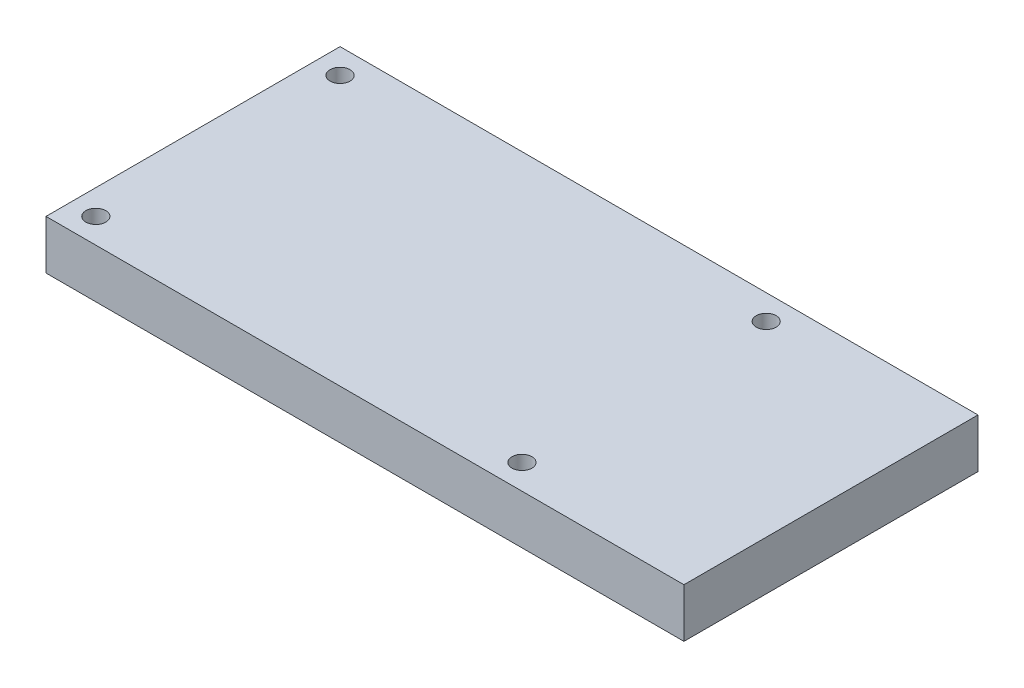
ISO-10303-21;
HEADER;
FILE_DESCRIPTION(('STEP AP214'),'2;1');
FILE_NAME('part.step','',(''),(''),'','','');
FILE_SCHEMA(('AUTOMOTIVE_DESIGN { 1 0 10303 214 1 1 1 1 }'));
ENDSEC;
DATA;
#1=APPLICATION_CONTEXT('core data for automotive mechanical design processes');
#2=APPLICATION_PROTOCOL_DEFINITION('international standard','automotive_design',2000,#1);
#3=PRODUCT_CONTEXT('',#1,'mechanical');
#4=PRODUCT('Part','Part','',(#3));
#5=PRODUCT_RELATED_PRODUCT_CATEGORY('part','',(#4));
#6=PRODUCT_DEFINITION_FORMATION('','',#4);
#7=PRODUCT_DEFINITION_CONTEXT('part definition',#1,'design');
#8=PRODUCT_DEFINITION('design','',#6,#7);
#9=PRODUCT_DEFINITION_SHAPE('','',#8);
#10=(LENGTH_UNIT() NAMED_UNIT(*) SI_UNIT(.MILLI.,.METRE.));
#11=(NAMED_UNIT(*) PLANE_ANGLE_UNIT() SI_UNIT($,.RADIAN.));
#12=(NAMED_UNIT(*) SI_UNIT($,.STERADIAN.) SOLID_ANGLE_UNIT());
#13=UNCERTAINTY_MEASURE_WITH_UNIT(LENGTH_MEASURE(1.E-05),#10,'distance_accuracy_value','');
#14=(GEOMETRIC_REPRESENTATION_CONTEXT(3) GLOBAL_UNCERTAINTY_ASSIGNED_CONTEXT((#13)) GLOBAL_UNIT_ASSIGNED_CONTEXT((#10,
#11,#12)) REPRESENTATION_CONTEXT('',''));
#15=CARTESIAN_POINT('',(0.,0.,0.));
#16=DIRECTION('',(0.,0.,1.));
#17=DIRECTION('',(1.,0.,0.));
#18=AXIS2_PLACEMENT_3D('',#15,#16,#17);
#19=CARTESIAN_POINT('',(0.,5.0038,0.));
#20=DIRECTION('',(0.,-1.,0.));
#21=DIRECTION('',(0.,0.,-1.));
#22=AXIS2_PLACEMENT_3D('',#19,#20,#21);
#23=PLANE('',#22);
#24=DIRECTION('',(0.,0.,-1.));
#25=VECTOR('',#24,1.);
#26=CARTESIAN_POINT('',(32.512,5.0038,14.986));
#27=LINE('',#26,#25);
#28=CARTESIAN_POINT('',(32.512,5.0038,14.986));
#29=VERTEX_POINT('',#28);
#30=CARTESIAN_POINT('',(32.512,5.0038,-14.986));
#31=VERTEX_POINT('',#30);
#32=EDGE_CURVE('E89',#29,#31,#27,.T.);
#33=ORIENTED_EDGE('',*,*,#32,.T.);
#34=DIRECTION('',(-1.,0.,0.));
#35=VECTOR('',#34,1.);
#36=CARTESIAN_POINT('',(-32.512,5.0038,-14.986));
#37=LINE('',#36,#35);
#38=CARTESIAN_POINT('',(-32.512,5.0038,-14.986));
#39=VERTEX_POINT('',#38);
#40=EDGE_CURVE('E84',#31,#39,#37,.T.);
#41=ORIENTED_EDGE('',*,*,#40,.T.);
#42=DIRECTION('',(0.,0.,1.));
#43=VECTOR('',#42,1.);
#44=CARTESIAN_POINT('',(-32.512,5.0038,14.986));
#45=LINE('',#44,#43);
#46=CARTESIAN_POINT('',(-32.512,5.0038,14.986));
#47=VERTEX_POINT('',#46);
#48=EDGE_CURVE('E87',#39,#47,#45,.T.);
#49=ORIENTED_EDGE('',*,*,#48,.T.);
#50=DIRECTION('',(1.,0.,0.));
#51=VECTOR('',#50,1.);
#52=CARTESIAN_POINT('',(-32.512,5.0038,14.986));
#53=LINE('',#52,#51);
#54=EDGE_CURVE('E54',#47,#29,#53,.T.);
#55=ORIENTED_EDGE('',*,*,#54,.T.);
#56=EDGE_LOOP('',(#33,#41,#49,#55));
#57=FACE_BOUND('',#56,.T.);
#58=CARTESIAN_POINT('',(-29.972,5.0038,-12.446));
#59=DIRECTION('',(0.,1.,0.));
#60=DIRECTION('',(0.,0.,1.));
#61=AXIS2_PLACEMENT_3D('',#58,#59,#60);
#62=CIRCLE('',#61,1.016);
#63=CARTESIAN_POINT('',(-29.972,5.0038,-11.43));
#64=VERTEX_POINT('',#63);
#65=EDGE_CURVE('E104',#64,#64,#62,.T.);
#66=ORIENTED_EDGE('',*,*,#65,.F.);
#67=EDGE_LOOP('',(#66));
#68=FACE_BOUND('',#67,.T.);
#69=CARTESIAN_POINT('',(-29.972,5.0038,12.446));
#70=DIRECTION('',(0.,1.,0.));
#71=DIRECTION('',(0.,0.,-1.));
#72=AXIS2_PLACEMENT_3D('',#69,#70,#71);
#73=CIRCLE('',#72,1.016);
#74=CARTESIAN_POINT('',(-29.972,5.0038,11.43));
#75=VERTEX_POINT('',#74);
#76=EDGE_CURVE('E119',#75,#75,#73,.T.);
#77=ORIENTED_EDGE('',*,*,#76,.F.);
#78=EDGE_LOOP('',(#77));
#79=FACE_BOUND('',#78,.T.);
#80=CARTESIAN_POINT('',(13.462,5.0038,-12.446));
#81=DIRECTION('',(0.,1.,0.));
#82=DIRECTION('',(0.,0.,1.));
#83=AXIS2_PLACEMENT_3D('',#80,#81,#82);
#84=CIRCLE('',#83,1.016);
#85=CARTESIAN_POINT('',(13.462,5.0038,-11.43));
#86=VERTEX_POINT('',#85);
#87=EDGE_CURVE('E125',#86,#86,#84,.T.);
#88=ORIENTED_EDGE('',*,*,#87,.F.);
#89=EDGE_LOOP('',(#88));
#90=FACE_BOUND('',#89,.T.);
#91=CARTESIAN_POINT('',(13.462,5.0038,12.446));
#92=DIRECTION('',(0.,1.,0.));
#93=DIRECTION('',(0.,0.,-1.));
#94=AXIS2_PLACEMENT_3D('',#91,#92,#93);
#95=CIRCLE('',#94,1.016);
#96=CARTESIAN_POINT('',(13.462,5.0038,11.43));
#97=VERTEX_POINT('',#96);
#98=EDGE_CURVE('E131',#97,#97,#95,.T.);
#99=ORIENTED_EDGE('',*,*,#98,.F.);
#100=EDGE_LOOP('',(#99));
#101=FACE_BOUND('',#100,.T.);
#102=ADVANCED_FACE('F37',(#57,#68,#79,#90,#101),#23,.F.);
#103=CARTESIAN_POINT('',(0.,0.,0.));
#104=DIRECTION('',(0.,-1.,0.));
#105=DIRECTION('',(0.,0.,-1.));
#106=AXIS2_PLACEMENT_3D('',#103,#104,#105);
#107=PLANE('',#106);
#108=CARTESIAN_POINT('',(13.462,0.,-12.446));
#109=DIRECTION('',(0.,1.,0.));
#110=DIRECTION('',(0.,0.,1.));
#111=AXIS2_PLACEMENT_3D('',#108,#109,#110);
#112=CIRCLE('',#111,1.016);
#113=CARTESIAN_POINT('',(13.462,0.,-11.43));
#114=VERTEX_POINT('',#113);
#115=EDGE_CURVE('E128',#114,#114,#112,.T.);
#116=ORIENTED_EDGE('',*,*,#115,.T.);
#117=EDGE_LOOP('',(#116));
#118=FACE_BOUND('',#117,.T.);
#119=CARTESIAN_POINT('',(-29.972,0.,-12.446));
#120=DIRECTION('',(0.,1.,0.));
#121=DIRECTION('',(0.,0.,1.));
#122=AXIS2_PLACEMENT_3D('',#119,#120,#121);
#123=CIRCLE('',#122,1.016);
#124=CARTESIAN_POINT('',(-29.972,0.,-11.43));
#125=VERTEX_POINT('',#124);
#126=EDGE_CURVE('E116',#125,#125,#123,.T.);
#127=ORIENTED_EDGE('',*,*,#126,.T.);
#128=EDGE_LOOP('',(#127));
#129=FACE_BOUND('',#128,.T.);
#130=DIRECTION('',(0.,0.,-1.));
#131=VECTOR('',#130,1.);
#132=CARTESIAN_POINT('',(32.512,0.,14.986));
#133=LINE('',#132,#131);
#134=CARTESIAN_POINT('',(32.512,0.,14.986));
#135=VERTEX_POINT('',#134);
#136=CARTESIAN_POINT('',(32.512,0.,-14.986));
#137=VERTEX_POINT('',#136);
#138=EDGE_CURVE('E101',#135,#137,#133,.T.);
#139=ORIENTED_EDGE('',*,*,#138,.F.);
#140=DIRECTION('',(1.,0.,0.));
#141=VECTOR('',#140,1.);
#142=CARTESIAN_POINT('',(-32.512,0.,14.986));
#143=LINE('',#142,#141);
#144=CARTESIAN_POINT('',(-32.512,0.,14.986));
#145=VERTEX_POINT('',#144);
#146=EDGE_CURVE('E77',#145,#135,#143,.T.);
#147=ORIENTED_EDGE('',*,*,#146,.F.);
#148=DIRECTION('',(0.,0.,1.));
#149=VECTOR('',#148,1.);
#150=CARTESIAN_POINT('',(-32.512,0.,14.986));
#151=LINE('',#150,#149);
#152=CARTESIAN_POINT('',(-32.512,0.,-14.986));
#153=VERTEX_POINT('',#152);
#154=EDGE_CURVE('E71',#153,#145,#151,.T.);
#155=ORIENTED_EDGE('',*,*,#154,.F.);
#156=DIRECTION('',(-1.,0.,0.));
#157=VECTOR('',#156,1.);
#158=CARTESIAN_POINT('',(-32.512,0.,-14.986));
#159=LINE('',#158,#157);
#160=EDGE_CURVE('E93',#137,#153,#159,.T.);
#161=ORIENTED_EDGE('',*,*,#160,.F.);
#162=EDGE_LOOP('',(#139,#147,#155,#161));
#163=FACE_BOUND('',#162,.T.);
#164=CARTESIAN_POINT('',(-29.972,0.,12.446));
#165=DIRECTION('',(0.,1.,0.));
#166=DIRECTION('',(0.,0.,-1.));
#167=AXIS2_PLACEMENT_3D('',#164,#165,#166);
#168=CIRCLE('',#167,1.016);
#169=CARTESIAN_POINT('',(-29.972,0.,11.43));
#170=VERTEX_POINT('',#169);
#171=EDGE_CURVE('E122',#170,#170,#168,.T.);
#172=ORIENTED_EDGE('',*,*,#171,.T.);
#173=EDGE_LOOP('',(#172));
#174=FACE_BOUND('',#173,.T.);
#175=CARTESIAN_POINT('',(13.462,0.,12.446));
#176=DIRECTION('',(0.,1.,0.));
#177=DIRECTION('',(0.,0.,-1.));
#178=AXIS2_PLACEMENT_3D('',#175,#176,#177);
#179=CIRCLE('',#178,1.016);
#180=CARTESIAN_POINT('',(13.462,0.,11.43));
#181=VERTEX_POINT('',#180);
#182=EDGE_CURVE('E134',#181,#181,#179,.T.);
#183=ORIENTED_EDGE('',*,*,#182,.T.);
#184=EDGE_LOOP('',(#183));
#185=FACE_BOUND('',#184,.T.);
#186=ADVANCED_FACE('F112',(#118,#129,#163,#174,#185),#107,.T.);
#187=CARTESIAN_POINT('',(32.512,5.0038,14.986));
#188=DIRECTION('',(-1.,0.,0.));
#189=DIRECTION('',(0.,0.,1.));
#190=AXIS2_PLACEMENT_3D('',#187,#188,#189);
#191=PLANE('',#190);
#192=ORIENTED_EDGE('',*,*,#138,.T.);
#193=DIRECTION('',(0.,-1.,0.));
#194=VECTOR('',#193,1.);
#195=CARTESIAN_POINT('',(32.512,5.0038,-14.986));
#196=LINE('',#195,#194);
#197=EDGE_CURVE('E11',#31,#137,#196,.T.);
#198=ORIENTED_EDGE('',*,*,#197,.F.);
#199=ORIENTED_EDGE('',*,*,#32,.F.);
#200=DIRECTION('',(0.,-1.,0.));
#201=VECTOR('',#200,1.);
#202=CARTESIAN_POINT('',(32.512,5.0038,14.986));
#203=LINE('',#202,#201);
#204=EDGE_CURVE('E97',#29,#135,#203,.T.);
#205=ORIENTED_EDGE('',*,*,#204,.T.);
#206=EDGE_LOOP('',(#192,#198,#199,#205));
#207=FACE_BOUND('',#206,.T.);
#208=ADVANCED_FACE('F39',(#207),#191,.F.);
#209=CARTESIAN_POINT('',(-32.512,5.0038,-14.986));
#210=DIRECTION('',(0.,0.,1.));
#211=DIRECTION('',(1.,0.,0.));
#212=AXIS2_PLACEMENT_3D('',#209,#210,#211);
#213=PLANE('',#212);
#214=ORIENTED_EDGE('',*,*,#160,.T.);
#215=DIRECTION('',(0.,-1.,0.));
#216=VECTOR('',#215,1.);
#217=CARTESIAN_POINT('',(-32.512,5.0038,-14.986));
#218=LINE('',#217,#216);
#219=EDGE_CURVE('E46',#39,#153,#218,.T.);
#220=ORIENTED_EDGE('',*,*,#219,.F.);
#221=ORIENTED_EDGE('',*,*,#40,.F.);
#222=ORIENTED_EDGE('',*,*,#197,.T.);
#223=EDGE_LOOP('',(#214,#220,#221,#222));
#224=FACE_BOUND('',#223,.T.);
#225=ADVANCED_FACE('F92',(#224),#213,.F.);
#226=CARTESIAN_POINT('',(-32.512,5.0038,14.986));
#227=DIRECTION('',(1.,0.,0.));
#228=DIRECTION('',(0.,0.,-1.));
#229=AXIS2_PLACEMENT_3D('',#226,#227,#228);
#230=PLANE('',#229);
#231=ORIENTED_EDGE('',*,*,#154,.T.);
#232=DIRECTION('',(0.,-1.,0.));
#233=VECTOR('',#232,1.);
#234=CARTESIAN_POINT('',(-32.512,5.0038,14.986));
#235=LINE('',#234,#233);
#236=EDGE_CURVE('E94',#47,#145,#235,.T.);
#237=ORIENTED_EDGE('',*,*,#236,.F.);
#238=ORIENTED_EDGE('',*,*,#48,.F.);
#239=ORIENTED_EDGE('',*,*,#219,.T.);
#240=EDGE_LOOP('',(#231,#237,#238,#239));
#241=FACE_BOUND('',#240,.T.);
#242=ADVANCED_FACE('F95',(#241),#230,.F.);
#243=CARTESIAN_POINT('',(-32.512,5.0038,14.986));
#244=DIRECTION('',(0.,0.,-1.));
#245=DIRECTION('',(-1.,0.,0.));
#246=AXIS2_PLACEMENT_3D('',#243,#244,#245);
#247=PLANE('',#246);
#248=ORIENTED_EDGE('',*,*,#146,.T.);
#249=ORIENTED_EDGE('',*,*,#204,.F.);
#250=ORIENTED_EDGE('',*,*,#54,.F.);
#251=ORIENTED_EDGE('',*,*,#236,.T.);
#252=EDGE_LOOP('',(#248,#249,#250,#251));
#253=FACE_BOUND('',#252,.T.);
#254=ADVANCED_FACE('F109',(#253),#247,.F.);
#255=CARTESIAN_POINT('',(-29.972,5.0038,-12.446));
#256=DIRECTION('',(0.,-1.,0.));
#257=DIRECTION('',(0.,0.,-1.));
#258=AXIS2_PLACEMENT_3D('',#255,#256,#257);
#259=CYLINDRICAL_SURFACE('',#258,1.016);
#260=ORIENTED_EDGE('',*,*,#65,.T.);
#261=EDGE_LOOP('',(#260));
#262=FACE_BOUND('',#261,.T.);
#263=ORIENTED_EDGE('',*,*,#126,.F.);
#264=EDGE_LOOP('',(#263));
#265=FACE_BOUND('',#264,.T.);
#266=ADVANCED_FACE('F151',(#262,#265),#259,.F.);
#267=CARTESIAN_POINT('',(-29.972,5.0038,12.446));
#268=DIRECTION('',(0.,-1.,0.));
#269=DIRECTION('',(0.,0.,-1.));
#270=AXIS2_PLACEMENT_3D('',#267,#268,#269);
#271=CYLINDRICAL_SURFACE('',#270,1.016);
#272=ORIENTED_EDGE('',*,*,#76,.T.);
#273=EDGE_LOOP('',(#272));
#274=FACE_BOUND('',#273,.T.);
#275=ORIENTED_EDGE('',*,*,#171,.F.);
#276=EDGE_LOOP('',(#275));
#277=FACE_BOUND('',#276,.T.);
#278=ADVANCED_FACE('F205',(#274,#277),#271,.F.);
#279=CARTESIAN_POINT('',(13.462,5.0038,-12.446));
#280=DIRECTION('',(0.,-1.,0.));
#281=DIRECTION('',(0.,0.,-1.));
#282=AXIS2_PLACEMENT_3D('',#279,#280,#281);
#283=CYLINDRICAL_SURFACE('',#282,1.016);
#284=ORIENTED_EDGE('',*,*,#87,.T.);
#285=EDGE_LOOP('',(#284));
#286=FACE_BOUND('',#285,.T.);
#287=ORIENTED_EDGE('',*,*,#115,.F.);
#288=EDGE_LOOP('',(#287));
#289=FACE_BOUND('',#288,.T.);
#290=ADVANCED_FACE('F214',(#286,#289),#283,.F.);
#291=CARTESIAN_POINT('',(13.462,5.0038,12.446));
#292=DIRECTION('',(0.,-1.,0.));
#293=DIRECTION('',(0.,0.,-1.));
#294=AXIS2_PLACEMENT_3D('',#291,#292,#293);
#295=CYLINDRICAL_SURFACE('',#294,1.016);
#296=ORIENTED_EDGE('',*,*,#98,.T.);
#297=EDGE_LOOP('',(#296));
#298=FACE_BOUND('',#297,.T.);
#299=ORIENTED_EDGE('',*,*,#182,.F.);
#300=EDGE_LOOP('',(#299));
#301=FACE_BOUND('',#300,.T.);
#302=ADVANCED_FACE('F140',(#298,#301),#295,.F.);
#303=CLOSED_SHELL('',(#102,#186,#208,#225,#242,#254,#266,#278,#290,#302));
#304=MANIFOLD_SOLID_BREP('B2',#303);
#305=ADVANCED_BREP_SHAPE_REPRESENTATION('',(#18,#304),#14);
#306=SHAPE_DEFINITION_REPRESENTATION(#9,#305);
ENDSEC;
END-ISO-10303-21;
